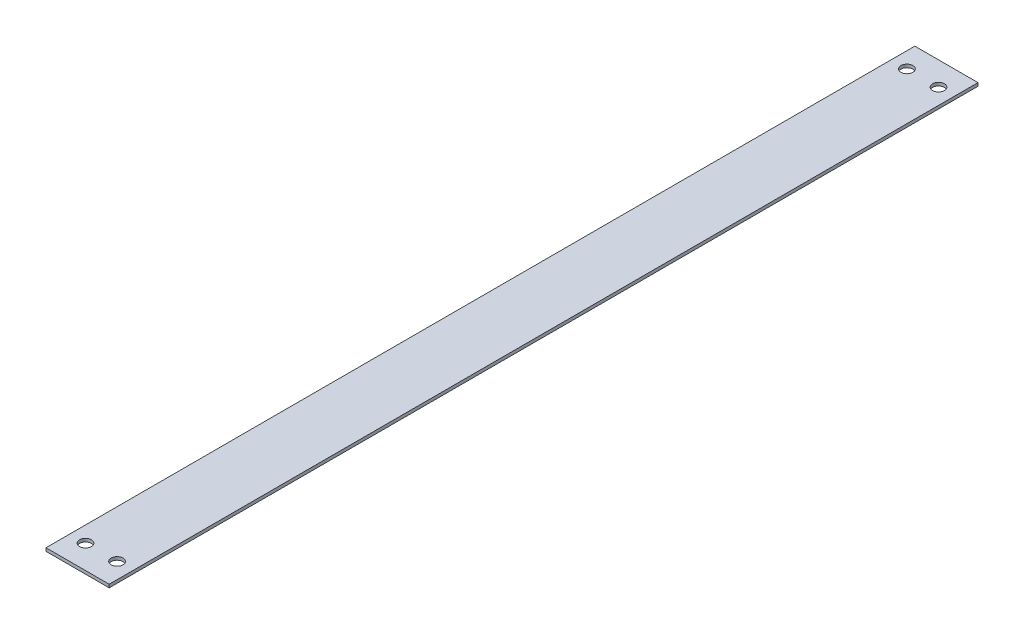
ISO-10303-21;
HEADER;
FILE_DESCRIPTION(('STEP AP214'),'2;1');
FILE_NAME('part.step','',(''),(''),'','','');
FILE_SCHEMA(('AUTOMOTIVE_DESIGN { 1 0 10303 214 1 1 1 1 }'));
ENDSEC;
DATA;
#1=APPLICATION_CONTEXT('core data for automotive mechanical design processes');
#2=APPLICATION_PROTOCOL_DEFINITION('international standard','automotive_design',2000,#1);
#3=PRODUCT_CONTEXT('',#1,'mechanical');
#4=PRODUCT('Part','Part','',(#3));
#5=PRODUCT_RELATED_PRODUCT_CATEGORY('part','',(#4));
#6=PRODUCT_DEFINITION_FORMATION('','',#4);
#7=PRODUCT_DEFINITION_CONTEXT('part definition',#1,'design');
#8=PRODUCT_DEFINITION('design','',#6,#7);
#9=PRODUCT_DEFINITION_SHAPE('','',#8);
#10=(LENGTH_UNIT() NAMED_UNIT(*) SI_UNIT(.MILLI.,.METRE.));
#11=(NAMED_UNIT(*) PLANE_ANGLE_UNIT() SI_UNIT($,.RADIAN.));
#12=(NAMED_UNIT(*) SI_UNIT($,.STERADIAN.) SOLID_ANGLE_UNIT());
#13=UNCERTAINTY_MEASURE_WITH_UNIT(LENGTH_MEASURE(1.E-05),#10,'distance_accuracy_value','');
#14=(GEOMETRIC_REPRESENTATION_CONTEXT(3) GLOBAL_UNCERTAINTY_ASSIGNED_CONTEXT((#13)) GLOBAL_UNIT_ASSIGNED_CONTEXT((#10,
#11,#12)) REPRESENTATION_CONTEXT('',''));
#15=CARTESIAN_POINT('',(0.,0.,0.));
#16=DIRECTION('',(0.,0.,1.));
#17=DIRECTION('',(1.,0.,0.));
#18=AXIS2_PLACEMENT_3D('',#15,#16,#17);
#19=CARTESIAN_POINT('',(25.4,2.54,349.25));
#20=DIRECTION('',(-1.,0.,0.));
#21=DIRECTION('',(0.,0.,1.));
#22=AXIS2_PLACEMENT_3D('',#19,#20,#21);
#23=PLANE('',#22);
#24=DIRECTION('',(0.,0.,-1.));
#25=VECTOR('',#24,1.);
#26=CARTESIAN_POINT('',(25.4,0.,349.25));
#27=LINE('',#26,#25);
#28=CARTESIAN_POINT('',(25.4,0.,349.25));
#29=VERTEX_POINT('',#28);
#30=CARTESIAN_POINT('',(25.4,0.,-349.25));
#31=VERTEX_POINT('',#30);
#32=EDGE_CURVE('E96',#29,#31,#27,.T.);
#33=ORIENTED_EDGE('',*,*,#32,.T.);
#34=DIRECTION('',(0.,-1.,0.));
#35=VECTOR('',#34,1.);
#36=CARTESIAN_POINT('',(25.4,2.54,-349.25));
#37=LINE('',#36,#35);
#38=CARTESIAN_POINT('',(25.4,2.54,-349.25));
#39=VERTEX_POINT('',#38);
#40=EDGE_CURVE('E11',#39,#31,#37,.T.);
#41=ORIENTED_EDGE('',*,*,#40,.F.);
#42=DIRECTION('',(0.,0.,-1.));
#43=VECTOR('',#42,1.);
#44=CARTESIAN_POINT('',(25.4,2.54,349.25));
#45=LINE('',#44,#43);
#46=CARTESIAN_POINT('',(25.4,2.54,349.25));
#47=VERTEX_POINT('',#46);
#48=EDGE_CURVE('E84',#47,#39,#45,.T.);
#49=ORIENTED_EDGE('',*,*,#48,.F.);
#50=DIRECTION('',(0.,-1.,0.));
#51=VECTOR('',#50,1.);
#52=CARTESIAN_POINT('',(25.4,2.54,349.25));
#53=LINE('',#52,#51);
#54=EDGE_CURVE('E92',#47,#29,#53,.T.);
#55=ORIENTED_EDGE('',*,*,#54,.T.);
#56=EDGE_LOOP('',(#33,#41,#49,#55));
#57=FACE_BOUND('',#56,.T.);
#58=ADVANCED_FACE('F33',(#57),#23,.F.);
#59=CARTESIAN_POINT('',(-25.4,2.54,-349.25));
#60=DIRECTION('',(0.,0.,1.));
#61=DIRECTION('',(1.,0.,0.));
#62=AXIS2_PLACEMENT_3D('',#59,#60,#61);
#63=PLANE('',#62);
#64=DIRECTION('',(-1.,0.,0.));
#65=VECTOR('',#64,1.);
#66=CARTESIAN_POINT('',(-25.4,0.,-349.25));
#67=LINE('',#66,#65);
#68=CARTESIAN_POINT('',(-25.4,0.,-349.25));
#69=VERTEX_POINT('',#68);
#70=EDGE_CURVE('E88',#31,#69,#67,.T.);
#71=ORIENTED_EDGE('',*,*,#70,.T.);
#72=DIRECTION('',(0.,-1.,0.));
#73=VECTOR('',#72,1.);
#74=CARTESIAN_POINT('',(-25.4,2.54,-349.25));
#75=LINE('',#74,#73);
#76=CARTESIAN_POINT('',(-25.4,2.54,-349.25));
#77=VERTEX_POINT('',#76);
#78=EDGE_CURVE('E41',#77,#69,#75,.T.);
#79=ORIENTED_EDGE('',*,*,#78,.F.);
#80=DIRECTION('',(-1.,0.,0.));
#81=VECTOR('',#80,1.);
#82=CARTESIAN_POINT('',(-25.4,2.54,-349.25));
#83=LINE('',#82,#81);
#84=EDGE_CURVE('E79',#39,#77,#83,.T.);
#85=ORIENTED_EDGE('',*,*,#84,.F.);
#86=ORIENTED_EDGE('',*,*,#40,.T.);
#87=EDGE_LOOP('',(#71,#79,#85,#86));
#88=FACE_BOUND('',#87,.T.);
#89=ADVANCED_FACE('F87',(#88),#63,.F.);
#90=CARTESIAN_POINT('',(-25.4,2.54,349.25));
#91=DIRECTION('',(1.,0.,0.));
#92=DIRECTION('',(0.,0.,-1.));
#93=AXIS2_PLACEMENT_3D('',#90,#91,#92);
#94=PLANE('',#93);
#95=DIRECTION('',(0.,0.,1.));
#96=VECTOR('',#95,1.);
#97=CARTESIAN_POINT('',(-25.4,0.,349.25));
#98=LINE('',#97,#96);
#99=CARTESIAN_POINT('',(-25.4,0.,349.25));
#100=VERTEX_POINT('',#99);
#101=EDGE_CURVE('E66',#69,#100,#98,.T.);
#102=ORIENTED_EDGE('',*,*,#101,.T.);
#103=DIRECTION('',(0.,-1.,0.));
#104=VECTOR('',#103,1.);
#105=CARTESIAN_POINT('',(-25.4,2.54,349.25));
#106=LINE('',#105,#104);
#107=CARTESIAN_POINT('',(-25.4,2.54,349.25));
#108=VERTEX_POINT('',#107);
#109=EDGE_CURVE('E89',#108,#100,#106,.T.);
#110=ORIENTED_EDGE('',*,*,#109,.F.);
#111=DIRECTION('',(0.,0.,1.));
#112=VECTOR('',#111,1.);
#113=CARTESIAN_POINT('',(-25.4,2.54,349.25));
#114=LINE('',#113,#112);
#115=EDGE_CURVE('E82',#77,#108,#114,.T.);
#116=ORIENTED_EDGE('',*,*,#115,.F.);
#117=ORIENTED_EDGE('',*,*,#78,.T.);
#118=EDGE_LOOP('',(#102,#110,#116,#117));
#119=FACE_BOUND('',#118,.T.);
#120=ADVANCED_FACE('F90',(#119),#94,.F.);
#121=CARTESIAN_POINT('',(-25.4,2.54,349.25));
#122=DIRECTION('',(0.,0.,-1.));
#123=DIRECTION('',(-1.,0.,0.));
#124=AXIS2_PLACEMENT_3D('',#121,#122,#123);
#125=PLANE('',#124);
#126=DIRECTION('',(1.,0.,0.));
#127=VECTOR('',#126,1.);
#128=CARTESIAN_POINT('',(-25.4,0.,349.25));
#129=LINE('',#128,#127);
#130=EDGE_CURVE('E72',#100,#29,#129,.T.);
#131=ORIENTED_EDGE('',*,*,#130,.T.);
#132=ORIENTED_EDGE('',*,*,#54,.F.);
#133=DIRECTION('',(1.,0.,0.));
#134=VECTOR('',#133,1.);
#135=CARTESIAN_POINT('',(-25.4,2.54,349.25));
#136=LINE('',#135,#134);
#137=EDGE_CURVE('E49',#108,#47,#136,.T.);
#138=ORIENTED_EDGE('',*,*,#137,.F.);
#139=ORIENTED_EDGE('',*,*,#109,.T.);
#140=EDGE_LOOP('',(#131,#132,#138,#139));
#141=FACE_BOUND('',#140,.T.);
#142=ADVANCED_FACE('F104',(#141),#125,.F.);
#143=CARTESIAN_POINT('',(0.,2.54,0.));
#144=DIRECTION('',(0.,-1.,0.));
#145=DIRECTION('',(0.,0.,-1.));
#146=AXIS2_PLACEMENT_3D('',#143,#144,#145);
#147=PLANE('',#146);
#148=CARTESIAN_POINT('',(-12.7,2.54,330.2));
#149=DIRECTION('',(0.,-1.,0.));
#150=DIRECTION('',(0.,0.,-1.));
#151=AXIS2_PLACEMENT_3D('',#148,#149,#150);
#152=CIRCLE('',#151,4.76250000000001);
#153=CARTESIAN_POINT('',(-12.7,2.54,325.4375));
#154=VERTEX_POINT('',#153);
#155=EDGE_CURVE('E99',#154,#154,#152,.T.);
#156=ORIENTED_EDGE('',*,*,#155,.T.);
#157=EDGE_LOOP('',(#156));
#158=FACE_BOUND('',#157,.T.);
#159=CARTESIAN_POINT('',(12.7,2.54,330.2));
#160=DIRECTION('',(0.,-1.,0.));
#161=DIRECTION('',(0.,0.,-1.));
#162=AXIS2_PLACEMENT_3D('',#159,#160,#161);
#163=CIRCLE('',#162,4.76250000000001);
#164=CARTESIAN_POINT('',(12.7,2.54,325.4375));
#165=VERTEX_POINT('',#164);
#166=EDGE_CURVE('E112',#165,#165,#163,.T.);
#167=ORIENTED_EDGE('',*,*,#166,.T.);
#168=EDGE_LOOP('',(#167));
#169=FACE_BOUND('',#168,.T.);
#170=CARTESIAN_POINT('',(12.7,2.54,-330.2));
#171=DIRECTION('',(0.,-1.,0.));
#172=DIRECTION('',(0.,0.,-1.));
#173=AXIS2_PLACEMENT_3D('',#170,#171,#172);
#174=CIRCLE('',#173,4.76250000000001);
#175=CARTESIAN_POINT('',(12.7,2.54,-334.9625));
#176=VERTEX_POINT('',#175);
#177=EDGE_CURVE('E115',#176,#176,#174,.T.);
#178=ORIENTED_EDGE('',*,*,#177,.T.);
#179=EDGE_LOOP('',(#178));
#180=FACE_BOUND('',#179,.T.);
#181=CARTESIAN_POINT('',(-12.7,2.54,-330.2));
#182=DIRECTION('',(0.,-1.,0.));
#183=DIRECTION('',(0.,0.,-1.));
#184=AXIS2_PLACEMENT_3D('',#181,#182,#183);
#185=CIRCLE('',#184,4.76250000000001);
#186=CARTESIAN_POINT('',(-12.7,2.54,-334.9625));
#187=VERTEX_POINT('',#186);
#188=EDGE_CURVE('E118',#187,#187,#185,.T.);
#189=ORIENTED_EDGE('',*,*,#188,.T.);
#190=EDGE_LOOP('',(#189));
#191=FACE_BOUND('',#190,.T.);
#192=ORIENTED_EDGE('',*,*,#48,.T.);
#193=ORIENTED_EDGE('',*,*,#84,.T.);
#194=ORIENTED_EDGE('',*,*,#115,.T.);
#195=ORIENTED_EDGE('',*,*,#137,.T.);
#196=EDGE_LOOP('',(#192,#193,#194,#195));
#197=FACE_BOUND('',#196,.T.);
#198=ADVANCED_FACE('F80',(#158,#169,#180,#191,#197),#147,.F.);
#199=CARTESIAN_POINT('',(0.,0.,0.));
#200=DIRECTION('',(0.,-1.,0.));
#201=DIRECTION('',(0.,0.,-1.));
#202=AXIS2_PLACEMENT_3D('',#199,#200,#201);
#203=PLANE('',#202);
#204=CARTESIAN_POINT('',(-12.7,0.,330.2));
#205=DIRECTION('',(0.,1.,0.));
#206=DIRECTION('',(0.,0.,-1.));
#207=AXIS2_PLACEMENT_3D('',#204,#205,#206);
#208=CIRCLE('',#207,4.76250000000001);
#209=CARTESIAN_POINT('',(-12.7,0.,325.4375));
#210=VERTEX_POINT('',#209);
#211=EDGE_CURVE('E125',#210,#210,#208,.T.);
#212=ORIENTED_EDGE('',*,*,#211,.T.);
#213=EDGE_LOOP('',(#212));
#214=FACE_BOUND('',#213,.T.);
#215=CARTESIAN_POINT('',(12.7,0.,330.2));
#216=DIRECTION('',(0.,1.,0.));
#217=DIRECTION('',(0.,0.,1.));
#218=AXIS2_PLACEMENT_3D('',#215,#216,#217);
#219=CIRCLE('',#218,4.76250000000001);
#220=CARTESIAN_POINT('',(12.7,0.,334.9625));
#221=VERTEX_POINT('',#220);
#222=EDGE_CURVE('E128',#221,#221,#219,.T.);
#223=ORIENTED_EDGE('',*,*,#222,.T.);
#224=EDGE_LOOP('',(#223));
#225=FACE_BOUND('',#224,.T.);
#226=CARTESIAN_POINT('',(12.7,0.,-330.2));
#227=DIRECTION('',(0.,1.,0.));
#228=DIRECTION('',(0.,0.,-1.));
#229=AXIS2_PLACEMENT_3D('',#226,#227,#228);
#230=CIRCLE('',#229,4.76250000000001);
#231=CARTESIAN_POINT('',(12.7,0.,-334.9625));
#232=VERTEX_POINT('',#231);
#233=EDGE_CURVE('E124',#232,#232,#230,.T.);
#234=ORIENTED_EDGE('',*,*,#233,.T.);
#235=EDGE_LOOP('',(#234));
#236=FACE_BOUND('',#235,.T.);
#237=CARTESIAN_POINT('',(-12.7,0.,-330.2));
#238=DIRECTION('',(0.,1.,0.));
#239=DIRECTION('',(0.,0.,1.));
#240=AXIS2_PLACEMENT_3D('',#237,#238,#239);
#241=CIRCLE('',#240,4.76250000000001);
#242=CARTESIAN_POINT('',(-12.7,0.,-325.4375));
#243=VERTEX_POINT('',#242);
#244=EDGE_CURVE('E121',#243,#243,#241,.T.);
#245=ORIENTED_EDGE('',*,*,#244,.T.);
#246=EDGE_LOOP('',(#245));
#247=FACE_BOUND('',#246,.T.);
#248=ORIENTED_EDGE('',*,*,#32,.F.);
#249=ORIENTED_EDGE('',*,*,#130,.F.);
#250=ORIENTED_EDGE('',*,*,#101,.F.);
#251=ORIENTED_EDGE('',*,*,#70,.F.);
#252=EDGE_LOOP('',(#248,#249,#250,#251));
#253=FACE_BOUND('',#252,.T.);
#254=ADVANCED_FACE('F107',(#214,#225,#236,#247,#253),#203,.T.);
#255=CARTESIAN_POINT('',(-12.7,0.,-330.2));
#256=DIRECTION('',(0.,1.,0.));
#257=DIRECTION('',(0.,0.,1.));
#258=AXIS2_PLACEMENT_3D('',#255,#256,#257);
#259=CYLINDRICAL_SURFACE('',#258,4.76250000000001);
#260=ORIENTED_EDGE('',*,*,#244,.F.);
#261=EDGE_LOOP('',(#260));
#262=FACE_BOUND('',#261,.T.);
#263=ORIENTED_EDGE('',*,*,#188,.F.);
#264=EDGE_LOOP('',(#263));
#265=FACE_BOUND('',#264,.T.);
#266=ADVANCED_FACE('F140',(#262,#265),#259,.F.);
#267=CARTESIAN_POINT('',(12.7,0.,-330.2));
#268=DIRECTION('',(0.,1.,0.));
#269=DIRECTION('',(0.,0.,1.));
#270=AXIS2_PLACEMENT_3D('',#267,#268,#269);
#271=CYLINDRICAL_SURFACE('',#270,4.76250000000001);
#272=ORIENTED_EDGE('',*,*,#233,.F.);
#273=EDGE_LOOP('',(#272));
#274=FACE_BOUND('',#273,.T.);
#275=ORIENTED_EDGE('',*,*,#177,.F.);
#276=EDGE_LOOP('',(#275));
#277=FACE_BOUND('',#276,.T.);
#278=ADVANCED_FACE('F136',(#274,#277),#271,.F.);
#279=CARTESIAN_POINT('',(12.7,0.,330.2));
#280=DIRECTION('',(0.,1.,0.));
#281=DIRECTION('',(0.,0.,1.));
#282=AXIS2_PLACEMENT_3D('',#279,#280,#281);
#283=CYLINDRICAL_SURFACE('',#282,4.76250000000001);
#284=ORIENTED_EDGE('',*,*,#222,.F.);
#285=EDGE_LOOP('',(#284));
#286=FACE_BOUND('',#285,.T.);
#287=ORIENTED_EDGE('',*,*,#166,.F.);
#288=EDGE_LOOP('',(#287));
#289=FACE_BOUND('',#288,.T.);
#290=ADVANCED_FACE('F139',(#286,#289),#283,.F.);
#291=CARTESIAN_POINT('',(-12.7,0.,330.2));
#292=DIRECTION('',(0.,1.,0.));
#293=DIRECTION('',(0.,0.,1.));
#294=AXIS2_PLACEMENT_3D('',#291,#292,#293);
#295=CYLINDRICAL_SURFACE('',#294,4.76250000000001);
#296=ORIENTED_EDGE('',*,*,#211,.F.);
#297=EDGE_LOOP('',(#296));
#298=FACE_BOUND('',#297,.T.);
#299=ORIENTED_EDGE('',*,*,#155,.F.);
#300=EDGE_LOOP('',(#299));
#301=FACE_BOUND('',#300,.T.);
#302=ADVANCED_FACE('F201',(#298,#301),#295,.F.);
#303=CLOSED_SHELL('',(#58,#89,#120,#142,#198,#254,#266,#278,#290,#302));
#304=MANIFOLD_SOLID_BREP('B2',#303);
#305=ADVANCED_BREP_SHAPE_REPRESENTATION('',(#18,#304),#14);
#306=SHAPE_DEFINITION_REPRESENTATION(#9,#305);
ENDSEC;
END-ISO-10303-21;
